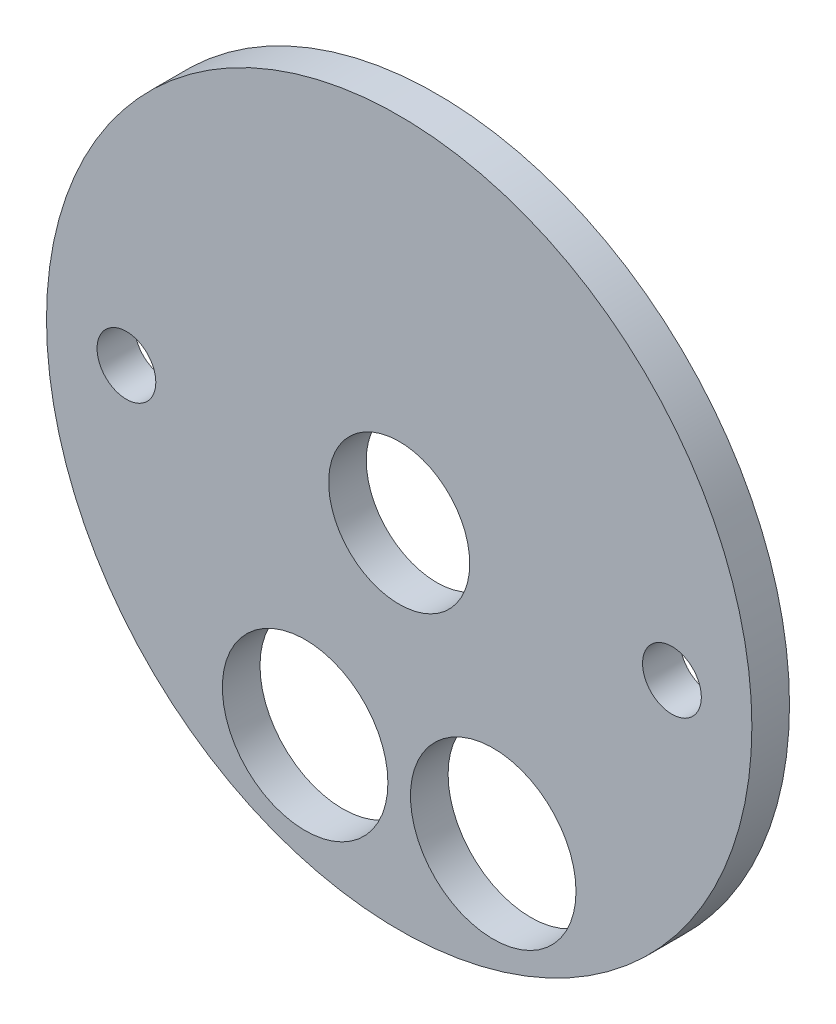
ISO-10303-21;
HEADER;
FILE_DESCRIPTION(('STEP AP214'),'2;1');
FILE_NAME('part.step','',(''),(''),'','','');
FILE_SCHEMA(('AUTOMOTIVE_DESIGN { 1 0 10303 214 1 1 1 1 }'));
ENDSEC;
DATA;
#1=APPLICATION_CONTEXT('core data for automotive mechanical design processes');
#2=APPLICATION_PROTOCOL_DEFINITION('international standard','automotive_design',2000,#1);
#3=PRODUCT_CONTEXT('',#1,'mechanical');
#4=PRODUCT('Part','Part','',(#3));
#5=PRODUCT_RELATED_PRODUCT_CATEGORY('part','',(#4));
#6=PRODUCT_DEFINITION_FORMATION('','',#4);
#7=PRODUCT_DEFINITION_CONTEXT('part definition',#1,'design');
#8=PRODUCT_DEFINITION('design','',#6,#7);
#9=PRODUCT_DEFINITION_SHAPE('','',#8);
#10=(LENGTH_UNIT() NAMED_UNIT(*) SI_UNIT(.MILLI.,.METRE.));
#11=(NAMED_UNIT(*) PLANE_ANGLE_UNIT() SI_UNIT($,.RADIAN.));
#12=(NAMED_UNIT(*) SI_UNIT($,.STERADIAN.) SOLID_ANGLE_UNIT());
#13=UNCERTAINTY_MEASURE_WITH_UNIT(LENGTH_MEASURE(1.E-05),#10,'distance_accuracy_value','');
#14=(GEOMETRIC_REPRESENTATION_CONTEXT(3) GLOBAL_UNCERTAINTY_ASSIGNED_CONTEXT((#13)) GLOBAL_UNIT_ASSIGNED_CONTEXT((#10,
#11,#12)) REPRESENTATION_CONTEXT('',''));
#15=CARTESIAN_POINT('',(0.,0.,0.));
#16=DIRECTION('',(0.,0.,1.));
#17=DIRECTION('',(1.,0.,0.));
#18=AXIS2_PLACEMENT_3D('',#15,#16,#17);
#19=CARTESIAN_POINT('',(-12.7,-31.1667936271924,0.));
#20=DIRECTION('',(0.,0.,1.));
#21=DIRECTION('',(1.,0.,0.));
#22=AXIS2_PLACEMENT_3D('',#19,#20,#21);
#23=CYLINDRICAL_SURFACE('',#22,11.176);
#24=CARTESIAN_POINT('',(-12.7,-31.1667936271924,10.16));
#25=DIRECTION('',(0.,0.,1.));
#26=DIRECTION('',(1.,0.,0.));
#27=AXIS2_PLACEMENT_3D('',#24,#25,#26);
#28=CIRCLE('',#27,11.176);
#29=CARTESIAN_POINT('',(-1.524,-31.1667936271924,10.16));
#30=VERTEX_POINT('',#29);
#31=EDGE_CURVE('E40',#30,#30,#28,.T.);
#32=ORIENTED_EDGE('',*,*,#31,.T.);
#33=EDGE_LOOP('',(#32));
#34=FACE_BOUND('',#33,.T.);
#35=CARTESIAN_POINT('',(-12.7,-31.1667936271924,5.08));
#36=DIRECTION('',(0.,0.,-1.));
#37=DIRECTION('',(-1.,0.,0.));
#38=AXIS2_PLACEMENT_3D('',#35,#36,#37);
#39=CIRCLE('',#38,11.176);
#40=CARTESIAN_POINT('',(-23.876,-31.1667936271924,5.08));
#41=VERTEX_POINT('',#40);
#42=EDGE_CURVE('E61',#41,#41,#39,.F.);
#43=ORIENTED_EDGE('',*,*,#42,.F.);
#44=EDGE_LOOP('',(#43));
#45=FACE_BOUND('',#44,.T.);
#46=ADVANCED_FACE('F32',(#34,#45),#23,.F.);
#47=CARTESIAN_POINT('',(0.,0.,0.));
#48=DIRECTION('',(0.,0.,1.));
#49=DIRECTION('',(1.,0.,0.));
#50=AXIS2_PLACEMENT_3D('',#47,#48,#49);
#51=CYLINDRICAL_SURFACE('',#50,9.525);
#52=CARTESIAN_POINT('',(0.,0.,10.16));
#53=DIRECTION('',(0.,0.,1.));
#54=DIRECTION('',(1.,0.,0.));
#55=AXIS2_PLACEMENT_3D('',#52,#53,#54);
#56=CIRCLE('',#55,9.525);
#57=CARTESIAN_POINT('',(9.525,0.,10.16));
#58=VERTEX_POINT('',#57);
#59=EDGE_CURVE('E53',#58,#58,#56,.T.);
#60=ORIENTED_EDGE('',*,*,#59,.T.);
#61=EDGE_LOOP('',(#60));
#62=FACE_BOUND('',#61,.T.);
#63=CARTESIAN_POINT('',(0.,0.,5.08));
#64=DIRECTION('',(0.,0.,-1.));
#65=DIRECTION('',(-1.,0.,0.));
#66=AXIS2_PLACEMENT_3D('',#63,#64,#65);
#67=CIRCLE('',#66,9.525);
#68=CARTESIAN_POINT('',(-9.525,0.,5.08));
#69=VERTEX_POINT('',#68);
#70=EDGE_CURVE('E64',#69,#69,#67,.F.);
#71=ORIENTED_EDGE('',*,*,#70,.F.);
#72=EDGE_LOOP('',(#71));
#73=FACE_BOUND('',#72,.T.);
#74=ADVANCED_FACE('F96',(#62,#73),#51,.F.);
#75=CARTESIAN_POINT('',(36.83,0.,0.));
#76=DIRECTION('',(0.,0.,1.));
#77=DIRECTION('',(1.,0.,0.));
#78=AXIS2_PLACEMENT_3D('',#75,#76,#77);
#79=CYLINDRICAL_SURFACE('',#78,3.96875);
#80=CARTESIAN_POINT('',(36.83,0.,10.16));
#81=DIRECTION('',(0.,0.,1.));
#82=DIRECTION('',(1.,0.,0.));
#83=AXIS2_PLACEMENT_3D('',#80,#81,#82);
#84=CIRCLE('',#83,3.96875);
#85=CARTESIAN_POINT('',(40.79875,0.,10.16));
#86=VERTEX_POINT('',#85);
#87=EDGE_CURVE('E50',#86,#86,#84,.T.);
#88=ORIENTED_EDGE('',*,*,#87,.T.);
#89=EDGE_LOOP('',(#88));
#90=FACE_BOUND('',#89,.T.);
#91=CARTESIAN_POINT('',(36.83,0.,5.08));
#92=DIRECTION('',(0.,0.,-1.));
#93=DIRECTION('',(-1.,0.,0.));
#94=AXIS2_PLACEMENT_3D('',#91,#92,#93);
#95=CIRCLE('',#94,3.96875);
#96=CARTESIAN_POINT('',(32.86125,0.,5.08));
#97=VERTEX_POINT('',#96);
#98=EDGE_CURVE('E67',#97,#97,#95,.F.);
#99=ORIENTED_EDGE('',*,*,#98,.F.);
#100=EDGE_LOOP('',(#99));
#101=FACE_BOUND('',#100,.T.);
#102=ADVANCED_FACE('F91',(#90,#101),#79,.F.);
#103=CARTESIAN_POINT('',(-36.83,0.,0.));
#104=DIRECTION('',(0.,0.,1.));
#105=DIRECTION('',(1.,0.,0.));
#106=AXIS2_PLACEMENT_3D('',#103,#104,#105);
#107=CYLINDRICAL_SURFACE('',#106,3.96875);
#108=CARTESIAN_POINT('',(-36.83,0.,10.16));
#109=DIRECTION('',(0.,0.,1.));
#110=DIRECTION('',(1.,0.,0.));
#111=AXIS2_PLACEMENT_3D('',#108,#109,#110);
#112=CIRCLE('',#111,3.96875);
#113=CARTESIAN_POINT('',(-32.86125,0.,10.16));
#114=VERTEX_POINT('',#113);
#115=EDGE_CURVE('E47',#114,#114,#112,.T.);
#116=ORIENTED_EDGE('',*,*,#115,.T.);
#117=EDGE_LOOP('',(#116));
#118=FACE_BOUND('',#117,.T.);
#119=CARTESIAN_POINT('',(-36.83,0.,5.08));
#120=DIRECTION('',(0.,0.,-1.));
#121=DIRECTION('',(-1.,0.,0.));
#122=AXIS2_PLACEMENT_3D('',#119,#120,#121);
#123=CIRCLE('',#122,3.96875);
#124=CARTESIAN_POINT('',(-40.79875,0.,5.08));
#125=VERTEX_POINT('',#124);
#126=EDGE_CURVE('E70',#125,#125,#123,.F.);
#127=ORIENTED_EDGE('',*,*,#126,.F.);
#128=EDGE_LOOP('',(#127));
#129=FACE_BOUND('',#128,.T.);
#130=ADVANCED_FACE('F82',(#118,#129),#107,.F.);
#131=CARTESIAN_POINT('',(12.7,-31.1667936271924,0.));
#132=DIRECTION('',(0.,0.,1.));
#133=DIRECTION('',(1.,0.,0.));
#134=AXIS2_PLACEMENT_3D('',#131,#132,#133);
#135=CYLINDRICAL_SURFACE('',#134,11.176);
#136=CARTESIAN_POINT('',(12.7,-31.1667936271924,10.16));
#137=DIRECTION('',(0.,0.,1.));
#138=DIRECTION('',(1.,0.,0.));
#139=AXIS2_PLACEMENT_3D('',#136,#137,#138);
#140=CIRCLE('',#139,11.176);
#141=CARTESIAN_POINT('',(23.876,-31.1667936271924,10.16));
#142=VERTEX_POINT('',#141);
#143=EDGE_CURVE('E44',#142,#142,#140,.T.);
#144=ORIENTED_EDGE('',*,*,#143,.T.);
#145=EDGE_LOOP('',(#144));
#146=FACE_BOUND('',#145,.T.);
#147=CARTESIAN_POINT('',(12.7,-31.1667936271924,5.08));
#148=DIRECTION('',(0.,0.,-1.));
#149=DIRECTION('',(-1.,0.,0.));
#150=AXIS2_PLACEMENT_3D('',#147,#148,#149);
#151=CIRCLE('',#150,11.176);
#152=CARTESIAN_POINT('',(1.524,-31.1667936271924,5.08));
#153=VERTEX_POINT('',#152);
#154=EDGE_CURVE('E36',#153,#153,#151,.F.);
#155=ORIENTED_EDGE('',*,*,#154,.F.);
#156=EDGE_LOOP('',(#155));
#157=FACE_BOUND('',#156,.T.);
#158=ADVANCED_FACE('F80',(#146,#157),#135,.F.);
#159=CARTESIAN_POINT('',(0.,0.,10.16));
#160=DIRECTION('',(0.,0.,-1.));
#161=DIRECTION('',(-1.,0.,0.));
#162=AXIS2_PLACEMENT_3D('',#159,#160,#161);
#163=CYLINDRICAL_SURFACE('',#162,47.625);
#164=CARTESIAN_POINT('',(0.,0.,10.16));
#165=DIRECTION('',(0.,0.,1.));
#166=DIRECTION('',(1.,0.,0.));
#167=AXIS2_PLACEMENT_3D('',#164,#165,#166);
#168=CIRCLE('',#167,47.625);
#169=CARTESIAN_POINT('',(47.625,0.,10.16));
#170=VERTEX_POINT('',#169);
#171=EDGE_CURVE('E10',#170,#170,#168,.T.);
#172=ORIENTED_EDGE('',*,*,#171,.F.);
#173=EDGE_LOOP('',(#172));
#174=FACE_BOUND('',#173,.T.);
#175=CARTESIAN_POINT('',(0.,0.,5.08));
#176=DIRECTION('',(0.,0.,-1.));
#177=DIRECTION('',(-1.,0.,0.));
#178=AXIS2_PLACEMENT_3D('',#175,#176,#177);
#179=CIRCLE('',#178,47.625);
#180=CARTESIAN_POINT('',(-47.625,0.,5.08));
#181=VERTEX_POINT('',#180);
#182=EDGE_CURVE('E56',#181,#181,#179,.T.);
#183=ORIENTED_EDGE('',*,*,#182,.F.);
#184=EDGE_LOOP('',(#183));
#185=FACE_BOUND('',#184,.T.);
#186=ADVANCED_FACE('F34',(#174,#185),#163,.T.);
#187=CARTESIAN_POINT('',(0.,0.,10.16));
#188=DIRECTION('',(0.,0.,1.));
#189=DIRECTION('',(1.,0.,0.));
#190=AXIS2_PLACEMENT_3D('',#187,#188,#189);
#191=PLANE('',#190);
#192=ORIENTED_EDGE('',*,*,#143,.F.);
#193=EDGE_LOOP('',(#192));
#194=FACE_BOUND('',#193,.T.);
#195=ORIENTED_EDGE('',*,*,#115,.F.);
#196=EDGE_LOOP('',(#195));
#197=FACE_BOUND('',#196,.T.);
#198=ORIENTED_EDGE('',*,*,#87,.F.);
#199=EDGE_LOOP('',(#198));
#200=FACE_BOUND('',#199,.T.);
#201=ORIENTED_EDGE('',*,*,#59,.F.);
#202=EDGE_LOOP('',(#201));
#203=FACE_BOUND('',#202,.T.);
#204=ORIENTED_EDGE('',*,*,#31,.F.);
#205=EDGE_LOOP('',(#204));
#206=FACE_BOUND('',#205,.T.);
#207=ORIENTED_EDGE('',*,*,#171,.T.);
#208=EDGE_LOOP('',(#207));
#209=FACE_BOUND('',#208,.T.);
#210=ADVANCED_FACE('F89',(#194,#197,#200,#203,#206,#209),#191,.T.);
#211=CARTESIAN_POINT('',(0.,0.,5.08));
#212=DIRECTION('',(0.,0.,-1.));
#213=DIRECTION('',(-1.,0.,0.));
#214=AXIS2_PLACEMENT_3D('',#211,#212,#213);
#215=PLANE('',#214);
#216=ORIENTED_EDGE('',*,*,#42,.T.);
#217=EDGE_LOOP('',(#216));
#218=FACE_BOUND('',#217,.T.);
#219=ORIENTED_EDGE('',*,*,#70,.T.);
#220=EDGE_LOOP('',(#219));
#221=FACE_BOUND('',#220,.T.);
#222=ORIENTED_EDGE('',*,*,#98,.T.);
#223=EDGE_LOOP('',(#222));
#224=FACE_BOUND('',#223,.T.);
#225=ORIENTED_EDGE('',*,*,#126,.T.);
#226=EDGE_LOOP('',(#225));
#227=FACE_BOUND('',#226,.T.);
#228=ORIENTED_EDGE('',*,*,#154,.T.);
#229=EDGE_LOOP('',(#228));
#230=FACE_BOUND('',#229,.T.);
#231=ORIENTED_EDGE('',*,*,#182,.T.);
#232=EDGE_LOOP('',(#231));
#233=FACE_BOUND('',#232,.T.);
#234=ADVANCED_FACE('F77',(#218,#221,#224,#227,#230,#233),#215,.T.);
#235=CLOSED_SHELL('',(#46,#74,#102,#130,#158,#186,#210,#234));
#236=MANIFOLD_SOLID_BREP('B2',#235);
#237=ADVANCED_BREP_SHAPE_REPRESENTATION('',(#18,#236),#14);
#238=SHAPE_DEFINITION_REPRESENTATION(#9,#237);
ENDSEC;
END-ISO-10303-21;
